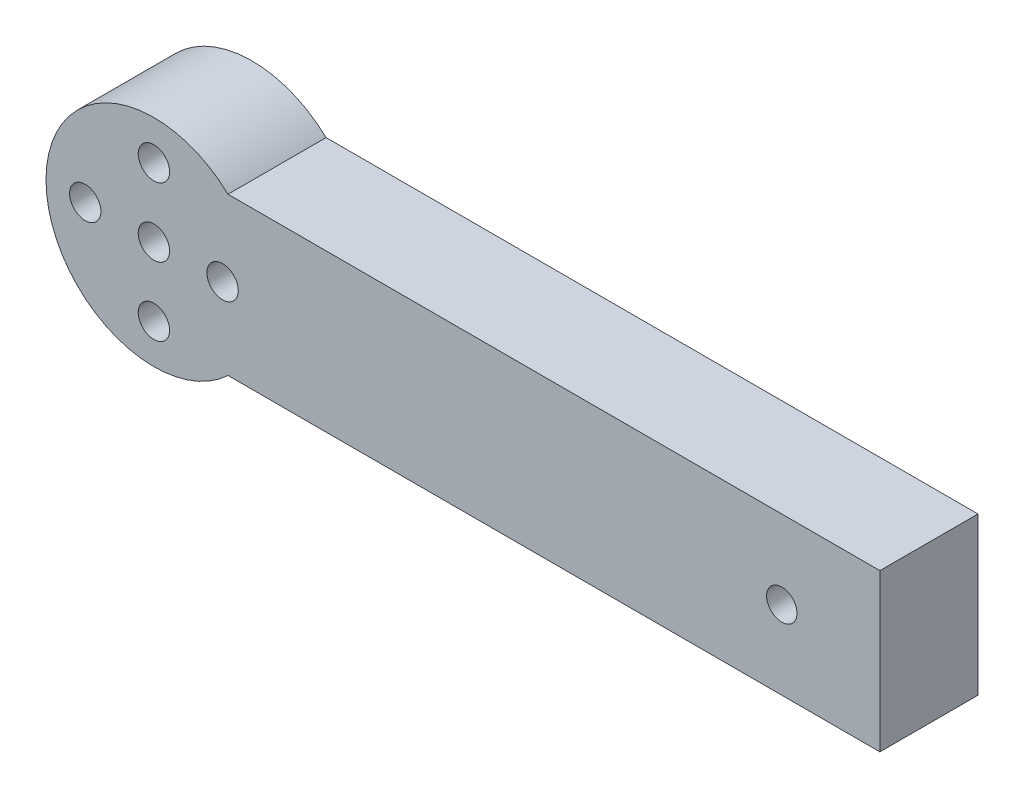
ISO-10303-21;
HEADER;
FILE_DESCRIPTION(('STEP AP214'),'2;1');
FILE_NAME('part.step','',(''),(''),'','','');
FILE_SCHEMA(('AUTOMOTIVE_DESIGN { 1 0 10303 214 1 1 1 1 }'));
ENDSEC;
DATA;
#1=APPLICATION_CONTEXT('core data for automotive mechanical design processes');
#2=APPLICATION_PROTOCOL_DEFINITION('international standard','automotive_design',2000,#1);
#3=PRODUCT_CONTEXT('',#1,'mechanical');
#4=PRODUCT('Part','Part','',(#3));
#5=PRODUCT_RELATED_PRODUCT_CATEGORY('part','',(#4));
#6=PRODUCT_DEFINITION_FORMATION('','',#4);
#7=PRODUCT_DEFINITION_CONTEXT('part definition',#1,'design');
#8=PRODUCT_DEFINITION('design','',#6,#7);
#9=PRODUCT_DEFINITION_SHAPE('','',#8);
#10=(LENGTH_UNIT() NAMED_UNIT(*) SI_UNIT(.MILLI.,.METRE.));
#11=(NAMED_UNIT(*) PLANE_ANGLE_UNIT() SI_UNIT($,.RADIAN.));
#12=(NAMED_UNIT(*) SI_UNIT($,.STERADIAN.) SOLID_ANGLE_UNIT());
#13=UNCERTAINTY_MEASURE_WITH_UNIT(LENGTH_MEASURE(1.E-05),#10,'distance_accuracy_value','');
#14=(GEOMETRIC_REPRESENTATION_CONTEXT(3) GLOBAL_UNCERTAINTY_ASSIGNED_CONTEXT((#13)) GLOBAL_UNIT_ASSIGNED_CONTEXT((#10,
#11,#12)) REPRESENTATION_CONTEXT('',''));
#15=CARTESIAN_POINT('',(0.,0.,0.));
#16=DIRECTION('',(0.,0.,1.));
#17=DIRECTION('',(1.,0.,0.));
#18=AXIS2_PLACEMENT_3D('',#15,#16,#17);
#19=CARTESIAN_POINT('',(8.,0.,10.));
#20=DIRECTION('',(0.,0.,1.));
#21=DIRECTION('',(1.,0.,0.));
#22=AXIS2_PLACEMENT_3D('',#19,#20,#21);
#23=PLANE('',#22);
#24=CARTESIAN_POINT('',(8.,-7.,10.));
#25=DIRECTION('',(0.,0.,1.));
#26=DIRECTION('',(1.,0.,0.));
#27=AXIS2_PLACEMENT_3D('',#24,#25,#26);
#28=CIRCLE('',#27,1.6);
#29=CARTESIAN_POINT('',(9.6,-7.,10.));
#30=VERTEX_POINT('',#29);
#31=EDGE_CURVE('E140',#30,#30,#28,.T.);
#32=ORIENTED_EDGE('',*,*,#31,.F.);
#33=EDGE_LOOP('',(#32));
#34=FACE_BOUND('',#33,.T.);
#35=CARTESIAN_POINT('',(8.,7.,10.));
#36=DIRECTION('',(0.,0.,1.));
#37=DIRECTION('',(1.,0.,0.));
#38=AXIS2_PLACEMENT_3D('',#35,#36,#37);
#39=CIRCLE('',#38,1.6);
#40=CARTESIAN_POINT('',(9.6,7.,10.));
#41=VERTEX_POINT('',#40);
#42=EDGE_CURVE('E128',#41,#41,#39,.T.);
#43=ORIENTED_EDGE('',*,*,#42,.F.);
#44=EDGE_LOOP('',(#43));
#45=FACE_BOUND('',#44,.T.);
#46=CARTESIAN_POINT('',(72.,0.,10.));
#47=DIRECTION('',(0.,0.,1.));
#48=DIRECTION('',(1.,0.,0.));
#49=AXIS2_PLACEMENT_3D('',#46,#47,#48);
#50=CIRCLE('',#49,1.54999999999999);
#51=CARTESIAN_POINT('',(73.55,0.,10.));
#52=VERTEX_POINT('',#51);
#53=EDGE_CURVE('E107',#52,#52,#50,.T.);
#54=ORIENTED_EDGE('',*,*,#53,.F.);
#55=EDGE_LOOP('',(#54));
#56=FACE_BOUND('',#55,.T.);
#57=DIRECTION('',(1.,0.,0.));
#58=VECTOR('',#57,1.);
#59=CARTESIAN_POINT('',(82.,-8.,10.));
#60=LINE('',#59,#58);
#61=CARTESIAN_POINT('',(15.5498344352707,-8.00000000000001,10.));
#62=VERTEX_POINT('',#61);
#63=CARTESIAN_POINT('',(82.,-8.,10.));
#64=VERTEX_POINT('',#63);
#65=EDGE_CURVE('E92',#62,#64,#60,.T.);
#66=ORIENTED_EDGE('',*,*,#65,.T.);
#67=DIRECTION('',(0.,1.,0.));
#68=VECTOR('',#67,1.);
#69=CARTESIAN_POINT('',(82.,8.,10.));
#70=LINE('',#69,#68);
#71=CARTESIAN_POINT('',(82.,8.,10.));
#72=VERTEX_POINT('',#71);
#73=EDGE_CURVE('E87',#64,#72,#70,.T.);
#74=ORIENTED_EDGE('',*,*,#73,.T.);
#75=DIRECTION('',(-1.,0.,0.));
#76=VECTOR('',#75,1.);
#77=CARTESIAN_POINT('',(82.,8.,10.));
#78=LINE('',#77,#76);
#79=CARTESIAN_POINT('',(15.5498344352707,8.00000000000001,10.));
#80=VERTEX_POINT('',#79);
#81=EDGE_CURVE('E90',#72,#80,#78,.T.);
#82=ORIENTED_EDGE('',*,*,#81,.T.);
#83=CARTESIAN_POINT('',(8.,0.,10.));
#84=DIRECTION('',(0.,0.,1.));
#85=DIRECTION('',(1.,0.,0.));
#86=AXIS2_PLACEMENT_3D('',#83,#84,#85);
#87=CIRCLE('',#86,11.);
#88=EDGE_CURVE('E57',#80,#62,#87,.T.);
#89=ORIENTED_EDGE('',*,*,#88,.T.);
#90=EDGE_LOOP('',(#66,#74,#82,#89));
#91=FACE_BOUND('',#90,.T.);
#92=CARTESIAN_POINT('',(8.,0.,10.));
#93=DIRECTION('',(0.,0.,1.));
#94=DIRECTION('',(1.,0.,0.));
#95=AXIS2_PLACEMENT_3D('',#92,#93,#94);
#96=CIRCLE('',#95,1.6);
#97=CARTESIAN_POINT('',(9.6,0.,10.));
#98=VERTEX_POINT('',#97);
#99=EDGE_CURVE('E122',#98,#98,#96,.T.);
#100=ORIENTED_EDGE('',*,*,#99,.F.);
#101=EDGE_LOOP('',(#100));
#102=FACE_BOUND('',#101,.T.);
#103=CARTESIAN_POINT('',(1.,0.,10.));
#104=DIRECTION('',(0.,0.,1.));
#105=DIRECTION('',(1.,0.,0.));
#106=AXIS2_PLACEMENT_3D('',#103,#104,#105);
#107=CIRCLE('',#106,1.6);
#108=CARTESIAN_POINT('',(2.6,0.,10.));
#109=VERTEX_POINT('',#108);
#110=EDGE_CURVE('E134',#109,#109,#107,.T.);
#111=ORIENTED_EDGE('',*,*,#110,.F.);
#112=EDGE_LOOP('',(#111));
#113=FACE_BOUND('',#112,.T.);
#114=CARTESIAN_POINT('',(15.,0.,10.));
#115=DIRECTION('',(0.,0.,1.));
#116=DIRECTION('',(1.,0.,0.));
#117=AXIS2_PLACEMENT_3D('',#114,#115,#116);
#118=CIRCLE('',#117,1.6);
#119=CARTESIAN_POINT('',(16.6,0.,10.));
#120=VERTEX_POINT('',#119);
#121=EDGE_CURVE('E146',#120,#120,#118,.T.);
#122=ORIENTED_EDGE('',*,*,#121,.F.);
#123=EDGE_LOOP('',(#122));
#124=FACE_BOUND('',#123,.T.);
#125=ADVANCED_FACE('F40',(#34,#45,#56,#91,#102,#113,#124),#23,.T.);
#126=CARTESIAN_POINT('',(8.,0.,0.));
#127=DIRECTION('',(0.,0.,1.));
#128=DIRECTION('',(1.,0.,0.));
#129=AXIS2_PLACEMENT_3D('',#126,#127,#128);
#130=PLANE('',#129);
#131=DIRECTION('',(1.,0.,0.));
#132=VECTOR('',#131,1.);
#133=CARTESIAN_POINT('',(82.,-8.,0.));
#134=LINE('',#133,#132);
#135=CARTESIAN_POINT('',(15.5498344352707,-8.00000000000001,0.));
#136=VERTEX_POINT('',#135);
#137=CARTESIAN_POINT('',(82.,-8.,0.));
#138=VERTEX_POINT('',#137);
#139=EDGE_CURVE('E104',#136,#138,#134,.T.);
#140=ORIENTED_EDGE('',*,*,#139,.F.);
#141=CARTESIAN_POINT('',(8.,0.,0.));
#142=DIRECTION('',(0.,0.,1.));
#143=DIRECTION('',(1.,0.,0.));
#144=AXIS2_PLACEMENT_3D('',#141,#142,#143);
#145=CIRCLE('',#144,11.);
#146=CARTESIAN_POINT('',(15.5498344352707,8.00000000000001,0.));
#147=VERTEX_POINT('',#146);
#148=EDGE_CURVE('E80',#147,#136,#145,.T.);
#149=ORIENTED_EDGE('',*,*,#148,.F.);
#150=DIRECTION('',(-1.,0.,0.));
#151=VECTOR('',#150,1.);
#152=CARTESIAN_POINT('',(82.,8.,0.));
#153=LINE('',#152,#151);
#154=CARTESIAN_POINT('',(82.,8.,0.));
#155=VERTEX_POINT('',#154);
#156=EDGE_CURVE('E74',#155,#147,#153,.T.);
#157=ORIENTED_EDGE('',*,*,#156,.F.);
#158=DIRECTION('',(0.,1.,0.));
#159=VECTOR('',#158,1.);
#160=CARTESIAN_POINT('',(82.,8.,0.));
#161=LINE('',#160,#159);
#162=EDGE_CURVE('E96',#138,#155,#161,.T.);
#163=ORIENTED_EDGE('',*,*,#162,.F.);
#164=EDGE_LOOP('',(#140,#149,#157,#163));
#165=FACE_BOUND('',#164,.T.);
#166=CARTESIAN_POINT('',(72.,0.,0.));
#167=DIRECTION('',(0.,0.,1.));
#168=DIRECTION('',(1.,0.,0.));
#169=AXIS2_PLACEMENT_3D('',#166,#167,#168);
#170=CIRCLE('',#169,1.54999999999999);
#171=CARTESIAN_POINT('',(73.55,0.,0.));
#172=VERTEX_POINT('',#171);
#173=EDGE_CURVE('E119',#172,#172,#170,.T.);
#174=ORIENTED_EDGE('',*,*,#173,.T.);
#175=EDGE_LOOP('',(#174));
#176=FACE_BOUND('',#175,.T.);
#177=CARTESIAN_POINT('',(8.,0.,0.));
#178=DIRECTION('',(0.,0.,1.));
#179=DIRECTION('',(1.,0.,0.));
#180=AXIS2_PLACEMENT_3D('',#177,#178,#179);
#181=CIRCLE('',#180,1.6);
#182=CARTESIAN_POINT('',(9.6,0.,0.));
#183=VERTEX_POINT('',#182);
#184=EDGE_CURVE('E125',#183,#183,#181,.T.);
#185=ORIENTED_EDGE('',*,*,#184,.T.);
#186=EDGE_LOOP('',(#185));
#187=FACE_BOUND('',#186,.T.);
#188=CARTESIAN_POINT('',(8.,7.,0.));
#189=DIRECTION('',(0.,0.,1.));
#190=DIRECTION('',(1.,0.,0.));
#191=AXIS2_PLACEMENT_3D('',#188,#189,#190);
#192=CIRCLE('',#191,1.6);
#193=CARTESIAN_POINT('',(9.6,7.,0.));
#194=VERTEX_POINT('',#193);
#195=EDGE_CURVE('E131',#194,#194,#192,.T.);
#196=ORIENTED_EDGE('',*,*,#195,.T.);
#197=EDGE_LOOP('',(#196));
#198=FACE_BOUND('',#197,.T.);
#199=CARTESIAN_POINT('',(1.,0.,0.));
#200=DIRECTION('',(0.,0.,1.));
#201=DIRECTION('',(1.,0.,0.));
#202=AXIS2_PLACEMENT_3D('',#199,#200,#201);
#203=CIRCLE('',#202,1.6);
#204=CARTESIAN_POINT('',(2.6,0.,0.));
#205=VERTEX_POINT('',#204);
#206=EDGE_CURVE('E137',#205,#205,#203,.T.);
#207=ORIENTED_EDGE('',*,*,#206,.T.);
#208=EDGE_LOOP('',(#207));
#209=FACE_BOUND('',#208,.T.);
#210=CARTESIAN_POINT('',(8.,-7.,0.));
#211=DIRECTION('',(0.,0.,1.));
#212=DIRECTION('',(1.,0.,0.));
#213=AXIS2_PLACEMENT_3D('',#210,#211,#212);
#214=CIRCLE('',#213,1.6);
#215=CARTESIAN_POINT('',(9.6,-7.,0.));
#216=VERTEX_POINT('',#215);
#217=EDGE_CURVE('E143',#216,#216,#214,.T.);
#218=ORIENTED_EDGE('',*,*,#217,.T.);
#219=EDGE_LOOP('',(#218));
#220=FACE_BOUND('',#219,.T.);
#221=CARTESIAN_POINT('',(15.,0.,0.));
#222=DIRECTION('',(0.,0.,1.));
#223=DIRECTION('',(1.,0.,0.));
#224=AXIS2_PLACEMENT_3D('',#221,#222,#223);
#225=CIRCLE('',#224,1.6);
#226=CARTESIAN_POINT('',(16.6,0.,0.));
#227=VERTEX_POINT('',#226);
#228=EDGE_CURVE('E149',#227,#227,#225,.T.);
#229=ORIENTED_EDGE('',*,*,#228,.T.);
#230=EDGE_LOOP('',(#229));
#231=FACE_BOUND('',#230,.T.);
#232=ADVANCED_FACE('F115',(#165,#176,#187,#198,#209,#220,#231),#130,.F.);
#233=CARTESIAN_POINT('',(82.,-8.,10.));
#234=DIRECTION('',(0.,1.,0.));
#235=DIRECTION('',(-1.,0.,0.));
#236=AXIS2_PLACEMENT_3D('',#233,#234,#235);
#237=PLANE('',#236);
#238=ORIENTED_EDGE('',*,*,#139,.T.);
#239=DIRECTION('',(0.,0.,-1.));
#240=VECTOR('',#239,1.);
#241=CARTESIAN_POINT('',(82.,-8.,10.));
#242=LINE('',#241,#240);
#243=EDGE_CURVE('E11',#64,#138,#242,.T.);
#244=ORIENTED_EDGE('',*,*,#243,.F.);
#245=ORIENTED_EDGE('',*,*,#65,.F.);
#246=DIRECTION('',(0.,0.,-1.));
#247=VECTOR('',#246,1.);
#248=CARTESIAN_POINT('',(15.5498344352707,-8.00000000000001,10.));
#249=LINE('',#248,#247);
#250=EDGE_CURVE('E100',#62,#136,#249,.T.);
#251=ORIENTED_EDGE('',*,*,#250,.T.);
#252=EDGE_LOOP('',(#238,#244,#245,#251));
#253=FACE_BOUND('',#252,.T.);
#254=ADVANCED_FACE('F42',(#253),#237,.F.);
#255=CARTESIAN_POINT('',(82.,8.,10.));
#256=DIRECTION('',(-1.,0.,0.));
#257=DIRECTION('',(0.,0.,1.));
#258=AXIS2_PLACEMENT_3D('',#255,#256,#257);
#259=PLANE('',#258);
#260=ORIENTED_EDGE('',*,*,#162,.T.);
#261=DIRECTION('',(0.,0.,-1.));
#262=VECTOR('',#261,1.);
#263=CARTESIAN_POINT('',(82.,8.,10.));
#264=LINE('',#263,#262);
#265=EDGE_CURVE('E49',#72,#155,#264,.T.);
#266=ORIENTED_EDGE('',*,*,#265,.F.);
#267=ORIENTED_EDGE('',*,*,#73,.F.);
#268=ORIENTED_EDGE('',*,*,#243,.T.);
#269=EDGE_LOOP('',(#260,#266,#267,#268));
#270=FACE_BOUND('',#269,.T.);
#271=ADVANCED_FACE('F95',(#270),#259,.F.);
#272=CARTESIAN_POINT('',(82.,8.,10.));
#273=DIRECTION('',(0.,-1.,0.));
#274=DIRECTION('',(1.,0.,0.));
#275=AXIS2_PLACEMENT_3D('',#272,#273,#274);
#276=PLANE('',#275);
#277=ORIENTED_EDGE('',*,*,#156,.T.);
#278=DIRECTION('',(0.,0.,-1.));
#279=VECTOR('',#278,1.);
#280=CARTESIAN_POINT('',(15.5498344352707,8.00000000000001,10.));
#281=LINE('',#280,#279);
#282=EDGE_CURVE('E97',#80,#147,#281,.T.);
#283=ORIENTED_EDGE('',*,*,#282,.F.);
#284=ORIENTED_EDGE('',*,*,#81,.F.);
#285=ORIENTED_EDGE('',*,*,#265,.T.);
#286=EDGE_LOOP('',(#277,#283,#284,#285));
#287=FACE_BOUND('',#286,.T.);
#288=ADVANCED_FACE('F98',(#287),#276,.F.);
#289=CARTESIAN_POINT('',(8.,0.,10.));
#290=DIRECTION('',(0.,0.,-1.));
#291=DIRECTION('',(-1.,0.,0.));
#292=AXIS2_PLACEMENT_3D('',#289,#290,#291);
#293=CYLINDRICAL_SURFACE('',#292,11.);
#294=ORIENTED_EDGE('',*,*,#148,.T.);
#295=ORIENTED_EDGE('',*,*,#250,.F.);
#296=ORIENTED_EDGE('',*,*,#88,.F.);
#297=ORIENTED_EDGE('',*,*,#282,.T.);
#298=EDGE_LOOP('',(#294,#295,#296,#297));
#299=FACE_BOUND('',#298,.T.);
#300=ADVANCED_FACE('F112',(#299),#293,.T.);
#301=CARTESIAN_POINT('',(72.,0.,10.));
#302=DIRECTION('',(0.,0.,-1.));
#303=DIRECTION('',(-1.,0.,0.));
#304=AXIS2_PLACEMENT_3D('',#301,#302,#303);
#305=CYLINDRICAL_SURFACE('',#304,1.54999999999999);
#306=ORIENTED_EDGE('',*,*,#53,.T.);
#307=EDGE_LOOP('',(#306));
#308=FACE_BOUND('',#307,.T.);
#309=ORIENTED_EDGE('',*,*,#173,.F.);
#310=EDGE_LOOP('',(#309));
#311=FACE_BOUND('',#310,.T.);
#312=ADVANCED_FACE('F168',(#308,#311),#305,.F.);
#313=CARTESIAN_POINT('',(8.,0.,10.));
#314=DIRECTION('',(0.,0.,-1.));
#315=DIRECTION('',(-1.,0.,0.));
#316=AXIS2_PLACEMENT_3D('',#313,#314,#315);
#317=CYLINDRICAL_SURFACE('',#316,1.6);
#318=ORIENTED_EDGE('',*,*,#99,.T.);
#319=EDGE_LOOP('',(#318));
#320=FACE_BOUND('',#319,.T.);
#321=ORIENTED_EDGE('',*,*,#184,.F.);
#322=EDGE_LOOP('',(#321));
#323=FACE_BOUND('',#322,.T.);
#324=ADVANCED_FACE('F222',(#320,#323),#317,.F.);
#325=CARTESIAN_POINT('',(8.,7.,10.));
#326=DIRECTION('',(0.,0.,-1.));
#327=DIRECTION('',(-1.,0.,0.));
#328=AXIS2_PLACEMENT_3D('',#325,#326,#327);
#329=CYLINDRICAL_SURFACE('',#328,1.6);
#330=ORIENTED_EDGE('',*,*,#42,.T.);
#331=EDGE_LOOP('',(#330));
#332=FACE_BOUND('',#331,.T.);
#333=ORIENTED_EDGE('',*,*,#195,.F.);
#334=EDGE_LOOP('',(#333));
#335=FACE_BOUND('',#334,.T.);
#336=ADVANCED_FACE('F231',(#332,#335),#329,.F.);
#337=CARTESIAN_POINT('',(1.,0.,10.));
#338=DIRECTION('',(0.,0.,-1.));
#339=DIRECTION('',(-1.,0.,0.));
#340=AXIS2_PLACEMENT_3D('',#337,#338,#339);
#341=CYLINDRICAL_SURFACE('',#340,1.6);
#342=ORIENTED_EDGE('',*,*,#110,.T.);
#343=EDGE_LOOP('',(#342));
#344=FACE_BOUND('',#343,.T.);
#345=ORIENTED_EDGE('',*,*,#206,.F.);
#346=EDGE_LOOP('',(#345));
#347=FACE_BOUND('',#346,.T.);
#348=ADVANCED_FACE('F240',(#344,#347),#341,.F.);
#349=CARTESIAN_POINT('',(8.,-7.,10.));
#350=DIRECTION('',(0.,0.,-1.));
#351=DIRECTION('',(-1.,0.,0.));
#352=AXIS2_PLACEMENT_3D('',#349,#350,#351);
#353=CYLINDRICAL_SURFACE('',#352,1.6);
#354=ORIENTED_EDGE('',*,*,#31,.T.);
#355=EDGE_LOOP('',(#354));
#356=FACE_BOUND('',#355,.T.);
#357=ORIENTED_EDGE('',*,*,#217,.F.);
#358=EDGE_LOOP('',(#357));
#359=FACE_BOUND('',#358,.T.);
#360=ADVANCED_FACE('F250',(#356,#359),#353,.F.);
#361=CARTESIAN_POINT('',(15.,0.,10.));
#362=DIRECTION('',(0.,0.,-1.));
#363=DIRECTION('',(-1.,0.,0.));
#364=AXIS2_PLACEMENT_3D('',#361,#362,#363);
#365=CYLINDRICAL_SURFACE('',#364,1.6);
#366=ORIENTED_EDGE('',*,*,#121,.T.);
#367=EDGE_LOOP('',(#366));
#368=FACE_BOUND('',#367,.T.);
#369=ORIENTED_EDGE('',*,*,#228,.F.);
#370=EDGE_LOOP('',(#369));
#371=FACE_BOUND('',#370,.T.);
#372=ADVANCED_FACE('F155',(#368,#371),#365,.F.);
#373=CLOSED_SHELL('',(#125,#232,#254,#271,#288,#300,#312,#324,#336,#348,#360,#372));
#374=MANIFOLD_SOLID_BREP('B2',#373);
#375=ADVANCED_BREP_SHAPE_REPRESENTATION('',(#18,#374),#14);
#376=SHAPE_DEFINITION_REPRESENTATION(#9,#375);
ENDSEC;
END-ISO-10303-21;
